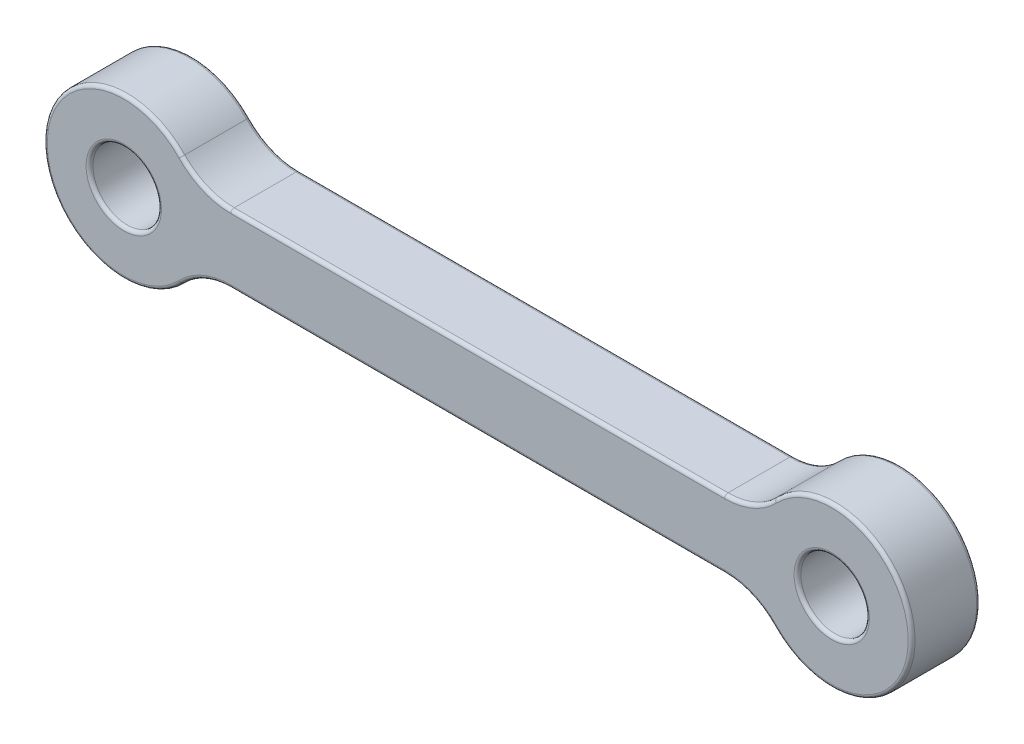
ISO-10303-21;
HEADER;
FILE_DESCRIPTION(('STEP AP214'),'2;1');
FILE_NAME('part.step','',(''),(''),'','','');
FILE_SCHEMA(('AUTOMOTIVE_DESIGN { 1 0 10303 214 1 1 1 1 }'));
ENDSEC;
DATA;
#1=APPLICATION_CONTEXT('core data for automotive mechanical design processes');
#2=APPLICATION_PROTOCOL_DEFINITION('international standard','automotive_design',2000,#1);
#3=PRODUCT_CONTEXT('',#1,'mechanical');
#4=PRODUCT('Part','Part','',(#3));
#5=PRODUCT_RELATED_PRODUCT_CATEGORY('part','',(#4));
#6=PRODUCT_DEFINITION_FORMATION('','',#4);
#7=PRODUCT_DEFINITION_CONTEXT('part definition',#1,'design');
#8=PRODUCT_DEFINITION('design','',#6,#7);
#9=PRODUCT_DEFINITION_SHAPE('','',#8);
#10=(LENGTH_UNIT() NAMED_UNIT(*) SI_UNIT(.MILLI.,.METRE.));
#11=(NAMED_UNIT(*) PLANE_ANGLE_UNIT() SI_UNIT($,.RADIAN.));
#12=(NAMED_UNIT(*) SI_UNIT($,.STERADIAN.) SOLID_ANGLE_UNIT());
#13=UNCERTAINTY_MEASURE_WITH_UNIT(LENGTH_MEASURE(1.E-05),#10,'distance_accuracy_value','');
#14=(GEOMETRIC_REPRESENTATION_CONTEXT(3) GLOBAL_UNCERTAINTY_ASSIGNED_CONTEXT((#13)) GLOBAL_UNIT_ASSIGNED_CONTEXT((#10,
#11,#12)) REPRESENTATION_CONTEXT('',''));
#15=CARTESIAN_POINT('',(0.,0.,0.));
#16=DIRECTION('',(0.,0.,1.));
#17=DIRECTION('',(1.,0.,0.));
#18=AXIS2_PLACEMENT_3D('',#15,#16,#17);
#19=CARTESIAN_POINT('',(0.,1.5,1.5));
#20=DIRECTION('',(0.,1.,0.));
#21=DIRECTION('',(0.,0.,1.));
#22=AXIS2_PLACEMENT_3D('',#19,#20,#21);
#23=PLANE('',#22);
#24=DIRECTION('',(0.,0.,1.));
#25=VECTOR('',#24,1.);
#26=CARTESIAN_POINT('',(26.3095842401766,1.5,-1.5));
#27=LINE('',#26,#25);
#28=CARTESIAN_POINT('',(26.3095842401766,1.5,1.35));
#29=VERTEX_POINT('',#28);
#30=CARTESIAN_POINT('',(26.3095842401766,1.5,-1.35));
#31=VERTEX_POINT('',#30);
#32=EDGE_CURVE('E316',#29,#31,#27,.F.);
#33=ORIENTED_EDGE('',*,*,#32,.T.);
#34=DIRECTION('',(1.,0.,0.));
#35=VECTOR('',#34,1.);
#36=CARTESIAN_POINT('',(4.69041575982343,1.5,-1.35));
#37=LINE('',#36,#35);
#38=CARTESIAN_POINT('',(4.69041575982343,1.5,-1.35));
#39=VERTEX_POINT('',#38);
#40=EDGE_CURVE('E215',#31,#39,#37,.F.);
#41=ORIENTED_EDGE('',*,*,#40,.T.);
#42=DIRECTION('',(0.,0.,-1.));
#43=VECTOR('',#42,1.);
#44=CARTESIAN_POINT('',(4.69041575982343,1.5,1.5));
#45=LINE('',#44,#43);
#46=CARTESIAN_POINT('',(4.69041575982343,1.5,1.35));
#47=VERTEX_POINT('',#46);
#48=EDGE_CURVE('E313',#39,#47,#45,.F.);
#49=ORIENTED_EDGE('',*,*,#48,.T.);
#50=DIRECTION('',(1.,0.,0.));
#51=VECTOR('',#50,1.);
#52=CARTESIAN_POINT('',(0.,1.5,1.35));
#53=LINE('',#52,#51);
#54=EDGE_CURVE('E213',#47,#29,#53,.T.);
#55=ORIENTED_EDGE('',*,*,#54,.T.);
#56=EDGE_LOOP('',(#33,#41,#49,#55));
#57=FACE_BOUND('',#56,.T.);
#58=ADVANCED_FACE('F35',(#57),#23,.T.);
#59=CARTESIAN_POINT('',(0.,0.,1.5));
#60=DIRECTION('',(0.,0.,-1.));
#61=DIRECTION('',(-1.,0.,0.));
#62=AXIS2_PLACEMENT_3D('',#59,#60,#61);
#63=CYLINDRICAL_SURFACE('',#62,3.5);
#64=DIRECTION('',(0.,0.,-1.));
#65=VECTOR('',#64,1.);
#66=CARTESIAN_POINT('',(2.52560848605877,2.42307692307692,1.5));
#67=LINE('',#66,#65);
#68=CARTESIAN_POINT('',(2.52560848605877,2.42307692307692,1.35));
#69=VERTEX_POINT('',#68);
#70=CARTESIAN_POINT('',(2.52560848605877,2.42307692307692,-1.35));
#71=VERTEX_POINT('',#70);
#72=EDGE_CURVE('E303',#69,#71,#67,.T.);
#73=ORIENTED_EDGE('',*,*,#72,.T.);
#74=CARTESIAN_POINT('',(0.,0.,-1.35));
#75=DIRECTION('',(0.,0.,1.));
#76=DIRECTION('',(1.,0.,0.));
#77=AXIS2_PLACEMENT_3D('',#74,#75,#76);
#78=CIRCLE('',#77,3.5);
#79=CARTESIAN_POINT('',(2.52560848605877,-2.42307692307692,-1.35));
#80=VERTEX_POINT('',#79);
#81=EDGE_CURVE('E223',#71,#80,#78,.T.);
#82=ORIENTED_EDGE('',*,*,#81,.T.);
#83=DIRECTION('',(0.,0.,-1.));
#84=VECTOR('',#83,1.);
#85=CARTESIAN_POINT('',(2.52560848605877,-2.42307692307692,1.5));
#86=LINE('',#85,#84);
#87=CARTESIAN_POINT('',(2.52560848605877,-2.42307692307692,1.35));
#88=VERTEX_POINT('',#87);
#89=EDGE_CURVE('E295',#80,#88,#86,.F.);
#90=ORIENTED_EDGE('',*,*,#89,.T.);
#91=CARTESIAN_POINT('',(0.,0.,1.35));
#92=DIRECTION('',(0.,0.,1.));
#93=DIRECTION('',(1.,0.,0.));
#94=AXIS2_PLACEMENT_3D('',#91,#92,#93);
#95=CIRCLE('',#94,3.5);
#96=EDGE_CURVE('E221',#88,#69,#95,.F.);
#97=ORIENTED_EDGE('',*,*,#96,.T.);
#98=EDGE_LOOP('',(#73,#82,#90,#97));
#99=FACE_BOUND('',#98,.T.);
#100=ADVANCED_FACE('F300',(#99),#63,.T.);
#101=CARTESIAN_POINT('',(0.,-1.5,1.5));
#102=DIRECTION('',(0.,1.,0.));
#103=DIRECTION('',(0.,0.,1.));
#104=AXIS2_PLACEMENT_3D('',#101,#102,#103);
#105=PLANE('',#104);
#106=DIRECTION('',(0.,0.,1.));
#107=VECTOR('',#106,1.);
#108=CARTESIAN_POINT('',(4.69041575982343,-1.5,-1.5));
#109=LINE('',#108,#107);
#110=CARTESIAN_POINT('',(4.69041575982343,-1.5,1.35));
#111=VERTEX_POINT('',#110);
#112=CARTESIAN_POINT('',(4.69041575982343,-1.5,-1.35));
#113=VERTEX_POINT('',#112);
#114=EDGE_CURVE('E297',#111,#113,#109,.F.);
#115=ORIENTED_EDGE('',*,*,#114,.T.);
#116=DIRECTION('',(1.,0.,0.));
#117=VECTOR('',#116,1.);
#118=CARTESIAN_POINT('',(0.,-1.5,-1.35));
#119=LINE('',#118,#117);
#120=CARTESIAN_POINT('',(26.3095842401766,-1.5,-1.35));
#121=VERTEX_POINT('',#120);
#122=EDGE_CURVE('E198',#113,#121,#119,.T.);
#123=ORIENTED_EDGE('',*,*,#122,.T.);
#124=DIRECTION('',(0.,0.,-1.));
#125=VECTOR('',#124,1.);
#126=CARTESIAN_POINT('',(26.3095842401766,-1.5,1.5));
#127=LINE('',#126,#125);
#128=CARTESIAN_POINT('',(26.3095842401766,-1.5,1.35));
#129=VERTEX_POINT('',#128);
#130=EDGE_CURVE('E258',#121,#129,#127,.F.);
#131=ORIENTED_EDGE('',*,*,#130,.T.);
#132=DIRECTION('',(1.,0.,0.));
#133=VECTOR('',#132,1.);
#134=CARTESIAN_POINT('',(4.69041575982343,-1.5,1.35));
#135=LINE('',#134,#133);
#136=EDGE_CURVE('E196',#129,#111,#135,.F.);
#137=ORIENTED_EDGE('',*,*,#136,.T.);
#138=EDGE_LOOP('',(#115,#123,#131,#137));
#139=FACE_BOUND('',#138,.T.);
#140=ADVANCED_FACE('F343',(#139),#105,.F.);
#141=CARTESIAN_POINT('',(0.,0.,1.5));
#142=DIRECTION('',(0.,0.,-1.));
#143=DIRECTION('',(-1.,0.,0.));
#144=AXIS2_PLACEMENT_3D('',#141,#142,#143);
#145=CYLINDRICAL_SURFACE('',#144,1.5);
#146=CARTESIAN_POINT('',(0.,0.,-1.35));
#147=DIRECTION('',(0.,0.,1.));
#148=DIRECTION('',(1.,0.,0.));
#149=AXIS2_PLACEMENT_3D('',#146,#147,#148);
#150=CIRCLE('',#149,1.5);
#151=CARTESIAN_POINT('',(1.5,0.,-1.35));
#152=VERTEX_POINT('',#151);
#153=EDGE_CURVE('E190',#152,#152,#150,.F.);
#154=ORIENTED_EDGE('',*,*,#153,.T.);
#155=EDGE_LOOP('',(#154));
#156=FACE_BOUND('',#155,.T.);
#157=CARTESIAN_POINT('',(0.,0.,1.35));
#158=DIRECTION('',(0.,0.,1.));
#159=DIRECTION('',(1.,0.,0.));
#160=AXIS2_PLACEMENT_3D('',#157,#158,#159);
#161=CIRCLE('',#160,1.5);
#162=CARTESIAN_POINT('',(1.5,0.,1.35));
#163=VERTEX_POINT('',#162);
#164=EDGE_CURVE('E187',#163,#163,#161,.T.);
#165=ORIENTED_EDGE('',*,*,#164,.T.);
#166=EDGE_LOOP('',(#165));
#167=FACE_BOUND('',#166,.T.);
#168=ADVANCED_FACE('F390',(#156,#167),#145,.F.);
#169=CARTESIAN_POINT('',(31.,0.,1.5));
#170=DIRECTION('',(0.,0.,-1.));
#171=DIRECTION('',(-1.,0.,0.));
#172=AXIS2_PLACEMENT_3D('',#169,#170,#171);
#173=CYLINDRICAL_SURFACE('',#172,3.5);
#174=DIRECTION('',(0.,0.,-1.));
#175=VECTOR('',#174,1.);
#176=CARTESIAN_POINT('',(28.4743915139412,-2.42307692307692,1.5));
#177=LINE('',#176,#175);
#178=CARTESIAN_POINT('',(28.4743915139412,-2.42307692307692,1.35));
#179=VERTEX_POINT('',#178);
#180=CARTESIAN_POINT('',(28.4743915139412,-2.42307692307692,-1.35));
#181=VERTEX_POINT('',#180);
#182=EDGE_CURVE('E306',#179,#181,#177,.T.);
#183=ORIENTED_EDGE('',*,*,#182,.T.);
#184=CARTESIAN_POINT('',(31.,0.,-1.35));
#185=DIRECTION('',(0.,0.,1.));
#186=DIRECTION('',(1.,0.,0.));
#187=AXIS2_PLACEMENT_3D('',#184,#185,#186);
#188=CIRCLE('',#187,3.5);
#189=CARTESIAN_POINT('',(28.4743915139412,2.42307692307692,-1.35));
#190=VERTEX_POINT('',#189);
#191=EDGE_CURVE('E206',#181,#190,#188,.T.);
#192=ORIENTED_EDGE('',*,*,#191,.T.);
#193=DIRECTION('',(0.,0.,-1.));
#194=VECTOR('',#193,1.);
#195=CARTESIAN_POINT('',(28.4743915139412,2.42307692307692,1.5));
#196=LINE('',#195,#194);
#197=CARTESIAN_POINT('',(28.4743915139412,2.42307692307692,1.35));
#198=VERTEX_POINT('',#197);
#199=EDGE_CURVE('E302',#190,#198,#196,.F.);
#200=ORIENTED_EDGE('',*,*,#199,.T.);
#201=CARTESIAN_POINT('',(31.,0.,1.35));
#202=DIRECTION('',(0.,0.,1.));
#203=DIRECTION('',(1.,0.,0.));
#204=AXIS2_PLACEMENT_3D('',#201,#202,#203);
#205=CIRCLE('',#204,3.5);
#206=EDGE_CURVE('E204',#198,#179,#205,.F.);
#207=ORIENTED_EDGE('',*,*,#206,.T.);
#208=EDGE_LOOP('',(#183,#192,#200,#207));
#209=FACE_BOUND('',#208,.T.);
#210=ADVANCED_FACE('F387',(#209),#173,.T.);
#211=CARTESIAN_POINT('',(31.,0.,1.5));
#212=DIRECTION('',(0.,0.,-1.));
#213=DIRECTION('',(-1.,0.,0.));
#214=AXIS2_PLACEMENT_3D('',#211,#212,#213);
#215=CYLINDRICAL_SURFACE('',#214,1.5);
#216=CARTESIAN_POINT('',(31.,0.,-1.35));
#217=DIRECTION('',(0.,0.,1.));
#218=DIRECTION('',(1.,0.,0.));
#219=AXIS2_PLACEMENT_3D('',#216,#217,#218);
#220=CIRCLE('',#219,1.5);
#221=CARTESIAN_POINT('',(32.5,0.,-1.35));
#222=VERTEX_POINT('',#221);
#223=EDGE_CURVE('E170',#222,#222,#220,.F.);
#224=ORIENTED_EDGE('',*,*,#223,.T.);
#225=EDGE_LOOP('',(#224));
#226=FACE_BOUND('',#225,.T.);
#227=CARTESIAN_POINT('',(31.,0.,1.35));
#228=DIRECTION('',(0.,0.,1.));
#229=DIRECTION('',(1.,0.,0.));
#230=AXIS2_PLACEMENT_3D('',#227,#228,#229);
#231=CIRCLE('',#230,1.5);
#232=CARTESIAN_POINT('',(32.5,0.,1.35));
#233=VERTEX_POINT('',#232);
#234=EDGE_CURVE('E319',#233,#233,#231,.T.);
#235=ORIENTED_EDGE('',*,*,#234,.T.);
#236=EDGE_LOOP('',(#235));
#237=FACE_BOUND('',#236,.T.);
#238=ADVANCED_FACE('F389',(#226,#237),#215,.F.);
#239=CARTESIAN_POINT('',(0.,0.,1.5));
#240=DIRECTION('',(0.,0.,1.));
#241=DIRECTION('',(1.,0.,0.));
#242=AXIS2_PLACEMENT_3D('',#239,#240,#241);
#243=PLANE('',#242);
#244=CARTESIAN_POINT('',(31.,0.,1.5));
#245=DIRECTION('',(0.,0.,1.));
#246=DIRECTION('',(1.,0.,0.));
#247=AXIS2_PLACEMENT_3D('',#244,#245,#246);
#248=CIRCLE('',#247,1.65);
#249=CARTESIAN_POINT('',(32.65,0.,1.5));
#250=VERTEX_POINT('',#249);
#251=EDGE_CURVE('E11',#250,#250,#248,.F.);
#252=ORIENTED_EDGE('',*,*,#251,.T.);
#253=EDGE_LOOP('',(#252));
#254=FACE_BOUND('',#253,.T.);
#255=CARTESIAN_POINT('',(0.,0.,1.5));
#256=DIRECTION('',(0.,0.,1.));
#257=DIRECTION('',(1.,0.,0.));
#258=AXIS2_PLACEMENT_3D('',#255,#256,#257);
#259=CIRCLE('',#258,1.65);
#260=CARTESIAN_POINT('',(1.65,0.,1.5));
#261=VERTEX_POINT('',#260);
#262=EDGE_CURVE('E44',#261,#261,#259,.F.);
#263=ORIENTED_EDGE('',*,*,#262,.T.);
#264=EDGE_LOOP('',(#263));
#265=FACE_BOUND('',#264,.T.);
#266=CARTESIAN_POINT('',(31.,0.,1.5));
#267=DIRECTION('',(0.,0.,1.));
#268=DIRECTION('',(1.,0.,0.));
#269=AXIS2_PLACEMENT_3D('',#266,#267,#268);
#270=CIRCLE('',#269,3.35);
#271=CARTESIAN_POINT('',(28.5826318776295,-2.31923076923077,1.5));
#272=VERTEX_POINT('',#271);
#273=CARTESIAN_POINT('',(28.5826318776295,2.31923076923077,1.5));
#274=VERTEX_POINT('',#273);
#275=EDGE_CURVE('E52',#272,#274,#270,.T.);
#276=ORIENTED_EDGE('',*,*,#275,.T.);
#277=CARTESIAN_POINT('',(26.3095842401766,4.5,1.5));
#278=DIRECTION('',(0.,0.,1.));
#279=DIRECTION('',(1.,0.,0.));
#280=AXIS2_PLACEMENT_3D('',#277,#278,#279);
#281=CIRCLE('',#280,3.15);
#282=CARTESIAN_POINT('',(26.3095842401766,1.35,1.5));
#283=VERTEX_POINT('',#282);
#284=EDGE_CURVE('E237',#274,#283,#281,.F.);
#285=ORIENTED_EDGE('',*,*,#284,.T.);
#286=DIRECTION('',(1.,0.,0.));
#287=VECTOR('',#286,1.);
#288=CARTESIAN_POINT('',(0.,1.35,1.5));
#289=LINE('',#288,#287);
#290=CARTESIAN_POINT('',(4.69041575982343,1.35,1.5));
#291=VERTEX_POINT('',#290);
#292=EDGE_CURVE('E225',#283,#291,#289,.F.);
#293=ORIENTED_EDGE('',*,*,#292,.T.);
#294=CARTESIAN_POINT('',(4.69041575982343,4.5,1.5));
#295=DIRECTION('',(0.,0.,1.));
#296=DIRECTION('',(1.,0.,0.));
#297=AXIS2_PLACEMENT_3D('',#294,#295,#296);
#298=CIRCLE('',#297,3.15);
#299=CARTESIAN_POINT('',(2.41736812237054,2.31923076923077,1.5));
#300=VERTEX_POINT('',#299);
#301=EDGE_CURVE('E227',#291,#300,#298,.F.);
#302=ORIENTED_EDGE('',*,*,#301,.T.);
#303=CARTESIAN_POINT('',(0.,0.,1.5));
#304=DIRECTION('',(0.,0.,1.));
#305=DIRECTION('',(1.,0.,0.));
#306=AXIS2_PLACEMENT_3D('',#303,#304,#305);
#307=CIRCLE('',#306,3.35);
#308=CARTESIAN_POINT('',(2.41736812237054,-2.31923076923077,1.5));
#309=VERTEX_POINT('',#308);
#310=EDGE_CURVE('E229',#300,#309,#307,.T.);
#311=ORIENTED_EDGE('',*,*,#310,.T.);
#312=CARTESIAN_POINT('',(4.69041575982343,-4.5,1.5));
#313=DIRECTION('',(0.,0.,1.));
#314=DIRECTION('',(1.,0.,0.));
#315=AXIS2_PLACEMENT_3D('',#312,#313,#314);
#316=CIRCLE('',#315,3.15);
#317=CARTESIAN_POINT('',(4.69041575982343,-1.35,1.5));
#318=VERTEX_POINT('',#317);
#319=EDGE_CURVE('E231',#309,#318,#316,.F.);
#320=ORIENTED_EDGE('',*,*,#319,.T.);
#321=DIRECTION('',(1.,0.,0.));
#322=VECTOR('',#321,1.);
#323=CARTESIAN_POINT('',(26.3095842401766,-1.35,1.5));
#324=LINE('',#323,#322);
#325=CARTESIAN_POINT('',(26.3095842401766,-1.35,1.5));
#326=VERTEX_POINT('',#325);
#327=EDGE_CURVE('E233',#318,#326,#324,.T.);
#328=ORIENTED_EDGE('',*,*,#327,.T.);
#329=CARTESIAN_POINT('',(26.3095842401766,-4.5,1.5));
#330=DIRECTION('',(0.,0.,1.));
#331=DIRECTION('',(1.,0.,0.));
#332=AXIS2_PLACEMENT_3D('',#329,#330,#331);
#333=CIRCLE('',#332,3.15);
#334=EDGE_CURVE('E57',#326,#272,#333,.F.);
#335=ORIENTED_EDGE('',*,*,#334,.T.);
#336=EDGE_LOOP('',(#276,#285,#293,#302,#311,#320,#328,#335));
#337=FACE_BOUND('',#336,.T.);
#338=ADVANCED_FACE('F360',(#254,#265,#337),#243,.T.);
#339=CARTESIAN_POINT('',(0.,0.,-1.5));
#340=DIRECTION('',(0.,0.,1.));
#341=DIRECTION('',(1.,0.,0.));
#342=AXIS2_PLACEMENT_3D('',#339,#340,#341);
#343=PLANE('',#342);
#344=CARTESIAN_POINT('',(31.,0.,-1.5));
#345=DIRECTION('',(0.,0.,1.));
#346=DIRECTION('',(1.,0.,0.));
#347=AXIS2_PLACEMENT_3D('',#344,#345,#346);
#348=CIRCLE('',#347,1.65);
#349=CARTESIAN_POINT('',(32.65,0.,-1.5));
#350=VERTEX_POINT('',#349);
#351=EDGE_CURVE('E179',#350,#350,#348,.T.);
#352=ORIENTED_EDGE('',*,*,#351,.T.);
#353=EDGE_LOOP('',(#352));
#354=FACE_BOUND('',#353,.T.);
#355=CARTESIAN_POINT('',(0.,0.,-1.5));
#356=DIRECTION('',(0.,0.,1.));
#357=DIRECTION('',(1.,0.,0.));
#358=AXIS2_PLACEMENT_3D('',#355,#356,#357);
#359=CIRCLE('',#358,1.65);
#360=CARTESIAN_POINT('',(1.65,0.,-1.5));
#361=VERTEX_POINT('',#360);
#362=EDGE_CURVE('E176',#361,#361,#359,.T.);
#363=ORIENTED_EDGE('',*,*,#362,.T.);
#364=EDGE_LOOP('',(#363));
#365=FACE_BOUND('',#364,.T.);
#366=DIRECTION('',(1.,0.,0.));
#367=VECTOR('',#366,1.);
#368=CARTESIAN_POINT('',(0.,-1.35,-1.5));
#369=LINE('',#368,#367);
#370=CARTESIAN_POINT('',(26.3095842401766,-1.35,-1.5));
#371=VERTEX_POINT('',#370);
#372=CARTESIAN_POINT('',(4.69041575982343,-1.35,-1.5));
#373=VERTEX_POINT('',#372);
#374=EDGE_CURVE('E174',#371,#373,#369,.F.);
#375=ORIENTED_EDGE('',*,*,#374,.T.);
#376=CARTESIAN_POINT('',(4.69041575982343,-4.5,-1.5));
#377=DIRECTION('',(0.,0.,1.));
#378=DIRECTION('',(1.,0.,0.));
#379=AXIS2_PLACEMENT_3D('',#376,#377,#378);
#380=CIRCLE('',#379,3.15);
#381=CARTESIAN_POINT('',(2.41736812237054,-2.31923076923077,-1.5));
#382=VERTEX_POINT('',#381);
#383=EDGE_CURVE('E155',#373,#382,#380,.T.);
#384=ORIENTED_EDGE('',*,*,#383,.T.);
#385=CARTESIAN_POINT('',(0.,0.,-1.5));
#386=DIRECTION('',(0.,0.,1.));
#387=DIRECTION('',(1.,0.,0.));
#388=AXIS2_PLACEMENT_3D('',#385,#386,#387);
#389=CIRCLE('',#388,3.35);
#390=CARTESIAN_POINT('',(2.41736812237054,2.31923076923077,-1.5));
#391=VERTEX_POINT('',#390);
#392=EDGE_CURVE('E163',#382,#391,#389,.F.);
#393=ORIENTED_EDGE('',*,*,#392,.T.);
#394=CARTESIAN_POINT('',(4.69041575982343,4.5,-1.5));
#395=DIRECTION('',(0.,0.,1.));
#396=DIRECTION('',(1.,0.,0.));
#397=AXIS2_PLACEMENT_3D('',#394,#395,#396);
#398=CIRCLE('',#397,3.15);
#399=CARTESIAN_POINT('',(4.69041575982343,1.35,-1.5));
#400=VERTEX_POINT('',#399);
#401=EDGE_CURVE('E169',#391,#400,#398,.T.);
#402=ORIENTED_EDGE('',*,*,#401,.T.);
#403=DIRECTION('',(1.,0.,0.));
#404=VECTOR('',#403,1.);
#405=CARTESIAN_POINT('',(26.3095842401766,1.35,-1.5));
#406=LINE('',#405,#404);
#407=CARTESIAN_POINT('',(26.3095842401766,1.35,-1.5));
#408=VERTEX_POINT('',#407);
#409=EDGE_CURVE('E325',#400,#408,#406,.T.);
#410=ORIENTED_EDGE('',*,*,#409,.T.);
#411=CARTESIAN_POINT('',(26.3095842401766,4.5,-1.5));
#412=DIRECTION('',(0.,0.,1.));
#413=DIRECTION('',(1.,0.,0.));
#414=AXIS2_PLACEMENT_3D('',#411,#412,#413);
#415=CIRCLE('',#414,3.15);
#416=CARTESIAN_POINT('',(28.5826318776295,2.31923076923077,-1.5));
#417=VERTEX_POINT('',#416);
#418=EDGE_CURVE('E327',#408,#417,#415,.T.);
#419=ORIENTED_EDGE('',*,*,#418,.T.);
#420=CARTESIAN_POINT('',(31.,0.,-1.5));
#421=DIRECTION('',(0.,0.,1.));
#422=DIRECTION('',(1.,0.,0.));
#423=AXIS2_PLACEMENT_3D('',#420,#421,#422);
#424=CIRCLE('',#423,3.35);
#425=CARTESIAN_POINT('',(28.5826318776295,-2.31923076923077,-1.5));
#426=VERTEX_POINT('',#425);
#427=EDGE_CURVE('E329',#417,#426,#424,.F.);
#428=ORIENTED_EDGE('',*,*,#427,.T.);
#429=CARTESIAN_POINT('',(26.3095842401766,-4.5,-1.5));
#430=DIRECTION('',(0.,0.,1.));
#431=DIRECTION('',(1.,0.,0.));
#432=AXIS2_PLACEMENT_3D('',#429,#430,#431);
#433=CIRCLE('',#432,3.15);
#434=EDGE_CURVE('E181',#426,#371,#433,.T.);
#435=ORIENTED_EDGE('',*,*,#434,.T.);
#436=EDGE_LOOP('',(#375,#384,#393,#402,#410,#419,#428,#435));
#437=FACE_BOUND('',#436,.T.);
#438=ADVANCED_FACE('F172',(#354,#365,#437),#343,.F.);
#439=CARTESIAN_POINT('',(4.69041575982343,-4.5,1.5));
#440=DIRECTION('',(0.,0.,-1.));
#441=DIRECTION('',(-1.,0.,0.));
#442=AXIS2_PLACEMENT_3D('',#439,#440,#441);
#443=CYLINDRICAL_SURFACE('',#442,3.);
#444=ORIENTED_EDGE('',*,*,#89,.F.);
#445=CARTESIAN_POINT('',(4.69041575982343,-4.5,-1.35));
#446=DIRECTION('',(0.,0.,1.));
#447=DIRECTION('',(1.,0.,0.));
#448=AXIS2_PLACEMENT_3D('',#445,#446,#447);
#449=CIRCLE('',#448,3.);
#450=EDGE_CURVE('E157',#80,#113,#449,.F.);
#451=ORIENTED_EDGE('',*,*,#450,.T.);
#452=ORIENTED_EDGE('',*,*,#114,.F.);
#453=CARTESIAN_POINT('',(4.69041575982343,-4.5,1.35));
#454=DIRECTION('',(0.,0.,1.));
#455=DIRECTION('',(1.,0.,0.));
#456=AXIS2_PLACEMENT_3D('',#453,#454,#455);
#457=CIRCLE('',#456,3.);
#458=EDGE_CURVE('E193',#111,#88,#457,.T.);
#459=ORIENTED_EDGE('',*,*,#458,.T.);
#460=EDGE_LOOP('',(#444,#451,#452,#459));
#461=FACE_BOUND('',#460,.T.);
#462=ADVANCED_FACE('F294',(#461),#443,.F.);
#463=CARTESIAN_POINT('',(26.3095842401766,-4.5,1.5));
#464=DIRECTION('',(0.,0.,-1.));
#465=DIRECTION('',(-1.,0.,0.));
#466=AXIS2_PLACEMENT_3D('',#463,#464,#465);
#467=CYLINDRICAL_SURFACE('',#466,3.);
#468=ORIENTED_EDGE('',*,*,#130,.F.);
#469=CARTESIAN_POINT('',(26.3095842401766,-4.5,-1.35));
#470=DIRECTION('',(0.,0.,1.));
#471=DIRECTION('',(1.,0.,0.));
#472=AXIS2_PLACEMENT_3D('',#469,#470,#471);
#473=CIRCLE('',#472,3.);
#474=EDGE_CURVE('E202',#121,#181,#473,.F.);
#475=ORIENTED_EDGE('',*,*,#474,.T.);
#476=ORIENTED_EDGE('',*,*,#182,.F.);
#477=CARTESIAN_POINT('',(26.3095842401766,-4.5,1.35));
#478=DIRECTION('',(0.,0.,1.));
#479=DIRECTION('',(1.,0.,0.));
#480=AXIS2_PLACEMENT_3D('',#477,#478,#479);
#481=CIRCLE('',#480,3.);
#482=EDGE_CURVE('E200',#179,#129,#481,.T.);
#483=ORIENTED_EDGE('',*,*,#482,.T.);
#484=EDGE_LOOP('',(#468,#475,#476,#483));
#485=FACE_BOUND('',#484,.T.);
#486=ADVANCED_FACE('F346',(#485),#467,.F.);
#487=CARTESIAN_POINT('',(26.3095842401766,4.5,1.5));
#488=DIRECTION('',(0.,0.,-1.));
#489=DIRECTION('',(-1.,0.,0.));
#490=AXIS2_PLACEMENT_3D('',#487,#488,#489);
#491=CYLINDRICAL_SURFACE('',#490,3.);
#492=ORIENTED_EDGE('',*,*,#199,.F.);
#493=CARTESIAN_POINT('',(26.3095842401766,4.5,-1.35));
#494=DIRECTION('',(0.,0.,1.));
#495=DIRECTION('',(1.,0.,0.));
#496=AXIS2_PLACEMENT_3D('',#493,#494,#495);
#497=CIRCLE('',#496,3.);
#498=EDGE_CURVE('E211',#190,#31,#497,.F.);
#499=ORIENTED_EDGE('',*,*,#498,.T.);
#500=ORIENTED_EDGE('',*,*,#32,.F.);
#501=CARTESIAN_POINT('',(26.3095842401766,4.5,1.35));
#502=DIRECTION('',(0.,0.,1.));
#503=DIRECTION('',(1.,0.,0.));
#504=AXIS2_PLACEMENT_3D('',#501,#502,#503);
#505=CIRCLE('',#504,3.);
#506=EDGE_CURVE('E208',#29,#198,#505,.T.);
#507=ORIENTED_EDGE('',*,*,#506,.T.);
#508=EDGE_LOOP('',(#492,#499,#500,#507));
#509=FACE_BOUND('',#508,.T.);
#510=ADVANCED_FACE('F376',(#509),#491,.F.);
#511=CARTESIAN_POINT('',(4.69041575982343,4.5,1.5));
#512=DIRECTION('',(0.,0.,-1.));
#513=DIRECTION('',(-1.,0.,0.));
#514=AXIS2_PLACEMENT_3D('',#511,#512,#513);
#515=CYLINDRICAL_SURFACE('',#514,3.);
#516=ORIENTED_EDGE('',*,*,#48,.F.);
#517=CARTESIAN_POINT('',(4.69041575982343,4.5,-1.35));
#518=DIRECTION('',(0.,0.,1.));
#519=DIRECTION('',(1.,0.,0.));
#520=AXIS2_PLACEMENT_3D('',#517,#518,#519);
#521=CIRCLE('',#520,3.);
#522=EDGE_CURVE('E219',#39,#71,#521,.F.);
#523=ORIENTED_EDGE('',*,*,#522,.T.);
#524=ORIENTED_EDGE('',*,*,#72,.F.);
#525=CARTESIAN_POINT('',(4.69041575982343,4.5,1.35));
#526=DIRECTION('',(0.,0.,1.));
#527=DIRECTION('',(1.,0.,0.));
#528=AXIS2_PLACEMENT_3D('',#525,#526,#527);
#529=CIRCLE('',#528,3.);
#530=EDGE_CURVE('E217',#69,#47,#529,.T.);
#531=ORIENTED_EDGE('',*,*,#530,.T.);
#532=EDGE_LOOP('',(#516,#523,#524,#531));
#533=FACE_BOUND('',#532,.T.);
#534=ADVANCED_FACE('F414',(#533),#515,.F.);
#535=CARTESIAN_POINT('',(31.,0.,-1.35));
#536=DIRECTION('',(0.,0.,1.));
#537=DIRECTION('',(1.,0.,0.));
#538=AXIS2_PLACEMENT_3D('',#535,#536,#537);
#539=TOROIDAL_SURFACE('',#538,1.65,0.15);
#540=ORIENTED_EDGE('',*,*,#351,.F.);
#541=EDGE_LOOP('',(#540));
#542=FACE_BOUND('',#541,.T.);
#543=ORIENTED_EDGE('',*,*,#223,.F.);
#544=EDGE_LOOP('',(#543));
#545=FACE_BOUND('',#544,.T.);
#546=ADVANCED_FACE('F417',(#542,#545),#539,.T.);
#547=CARTESIAN_POINT('',(0.,0.,-1.35));
#548=DIRECTION('',(0.,0.,1.));
#549=DIRECTION('',(1.,0.,0.));
#550=AXIS2_PLACEMENT_3D('',#547,#548,#549);
#551=TOROIDAL_SURFACE('',#550,1.65,0.15);
#552=ORIENTED_EDGE('',*,*,#153,.F.);
#553=EDGE_LOOP('',(#552));
#554=FACE_BOUND('',#553,.T.);
#555=ORIENTED_EDGE('',*,*,#362,.F.);
#556=EDGE_LOOP('',(#555));
#557=FACE_BOUND('',#556,.T.);
#558=ADVANCED_FACE('F421',(#554,#557),#551,.T.);
#559=CARTESIAN_POINT('',(26.3095842401766,4.5,-1.35));
#560=DIRECTION('',(0.,0.,1.));
#561=DIRECTION('',(1.,0.,0.));
#562=AXIS2_PLACEMENT_3D('',#559,#560,#561);
#563=TOROIDAL_SURFACE('',#562,3.15,0.15);
#564=CARTESIAN_POINT('',(26.3095842401766,1.35,-1.35));
#565=DIRECTION('',(-1.,0.,0.));
#566=DIRECTION('',(0.,0.,1.));
#567=AXIS2_PLACEMENT_3D('',#564,#565,#566);
#568=CIRCLE('',#567,0.15);
#569=EDGE_CURVE('E252',#31,#408,#568,.T.);
#570=ORIENTED_EDGE('',*,*,#569,.F.);
#571=ORIENTED_EDGE('',*,*,#498,.F.);
#572=CARTESIAN_POINT('',(28.5826318776295,2.31923076923077,-1.35));
#573=DIRECTION('',(0.692307692307703,0.72160242458821,0.));
#574=DIRECTION('',(-0.72160242458821,0.692307692307703,0.));
#575=AXIS2_PLACEMENT_3D('',#572,#573,#574);
#576=CIRCLE('',#575,0.15);
#577=EDGE_CURVE('E255',#417,#190,#576,.T.);
#578=ORIENTED_EDGE('',*,*,#577,.F.);
#579=ORIENTED_EDGE('',*,*,#418,.F.);
#580=EDGE_LOOP('',(#570,#571,#578,#579));
#581=FACE_BOUND('',#580,.T.);
#582=ADVANCED_FACE('F380',(#581),#563,.T.);
#583=CARTESIAN_POINT('',(31.,0.,-1.35));
#584=DIRECTION('',(0.,0.,1.));
#585=DIRECTION('',(1.,0.,0.));
#586=AXIS2_PLACEMENT_3D('',#583,#584,#585);
#587=TOROIDAL_SURFACE('',#586,3.35,0.15);
#588=ORIENTED_EDGE('',*,*,#577,.T.);
#589=ORIENTED_EDGE('',*,*,#191,.F.);
#590=CARTESIAN_POINT('',(28.5826318776295,-2.31923076923077,-1.35));
#591=DIRECTION('',(-0.692307692307698,0.721602424588214,0.));
#592=DIRECTION('',(-0.721602424588214,-0.692307692307698,0.));
#593=AXIS2_PLACEMENT_3D('',#590,#591,#592);
#594=CIRCLE('',#593,0.15);
#595=EDGE_CURVE('E249',#426,#181,#594,.T.);
#596=ORIENTED_EDGE('',*,*,#595,.F.);
#597=ORIENTED_EDGE('',*,*,#427,.F.);
#598=EDGE_LOOP('',(#588,#589,#596,#597));
#599=FACE_BOUND('',#598,.T.);
#600=ADVANCED_FACE('F385',(#599),#587,.T.);
#601=CARTESIAN_POINT('',(0.,1.35,-1.35));
#602=DIRECTION('',(-1.,0.,0.));
#603=DIRECTION('',(0.,0.,1.));
#604=AXIS2_PLACEMENT_3D('',#601,#602,#603);
#605=CYLINDRICAL_SURFACE('',#604,0.15);
#606=ORIENTED_EDGE('',*,*,#569,.T.);
#607=ORIENTED_EDGE('',*,*,#409,.F.);
#608=CARTESIAN_POINT('',(4.69041575982343,1.35,-1.35));
#609=DIRECTION('',(-1.,0.,0.));
#610=DIRECTION('',(0.,0.,1.));
#611=AXIS2_PLACEMENT_3D('',#608,#609,#610);
#612=CIRCLE('',#611,0.15);
#613=EDGE_CURVE('E246',#39,#400,#612,.T.);
#614=ORIENTED_EDGE('',*,*,#613,.F.);
#615=ORIENTED_EDGE('',*,*,#40,.F.);
#616=EDGE_LOOP('',(#606,#607,#614,#615));
#617=FACE_BOUND('',#616,.T.);
#618=ADVANCED_FACE('F439',(#617),#605,.T.);
#619=CARTESIAN_POINT('',(26.3095842401766,-4.5,-1.35));
#620=DIRECTION('',(0.,0.,1.));
#621=DIRECTION('',(1.,0.,0.));
#622=AXIS2_PLACEMENT_3D('',#619,#620,#621);
#623=TOROIDAL_SURFACE('',#622,3.15,0.15);
#624=ORIENTED_EDGE('',*,*,#595,.T.);
#625=ORIENTED_EDGE('',*,*,#474,.F.);
#626=CARTESIAN_POINT('',(26.3095842401766,-1.35,-1.35));
#627=DIRECTION('',(-1.,0.,0.));
#628=DIRECTION('',(0.,0.,1.));
#629=AXIS2_PLACEMENT_3D('',#626,#627,#628);
#630=CIRCLE('',#629,0.15);
#631=EDGE_CURVE('E243',#371,#121,#630,.T.);
#632=ORIENTED_EDGE('',*,*,#631,.F.);
#633=ORIENTED_EDGE('',*,*,#434,.F.);
#634=EDGE_LOOP('',(#624,#625,#632,#633));
#635=FACE_BOUND('',#634,.T.);
#636=ADVANCED_FACE('F336',(#635),#623,.T.);
#637=CARTESIAN_POINT('',(4.69041575982343,4.5,-1.35));
#638=DIRECTION('',(0.,0.,1.));
#639=DIRECTION('',(1.,0.,0.));
#640=AXIS2_PLACEMENT_3D('',#637,#638,#639);
#641=TOROIDAL_SURFACE('',#640,3.15,0.15);
#642=ORIENTED_EDGE('',*,*,#613,.T.);
#643=ORIENTED_EDGE('',*,*,#401,.F.);
#644=CARTESIAN_POINT('',(2.41736812237054,2.31923076923077,-1.35));
#645=DIRECTION('',(-0.692307692307693,0.72160242458822,0.));
#646=DIRECTION('',(-0.72160242458822,-0.692307692307693,0.));
#647=AXIS2_PLACEMENT_3D('',#644,#645,#646);
#648=CIRCLE('',#647,0.15);
#649=EDGE_CURVE('E166',#71,#391,#648,.T.);
#650=ORIENTED_EDGE('',*,*,#649,.F.);
#651=ORIENTED_EDGE('',*,*,#522,.F.);
#652=EDGE_LOOP('',(#642,#643,#650,#651));
#653=FACE_BOUND('',#652,.T.);
#654=ADVANCED_FACE('F433',(#653),#641,.T.);
#655=CARTESIAN_POINT('',(0.,-1.35,-1.35));
#656=DIRECTION('',(1.,0.,0.));
#657=DIRECTION('',(0.,0.,-1.));
#658=AXIS2_PLACEMENT_3D('',#655,#656,#657);
#659=CYLINDRICAL_SURFACE('',#658,0.15);
#660=ORIENTED_EDGE('',*,*,#631,.T.);
#661=ORIENTED_EDGE('',*,*,#122,.F.);
#662=CARTESIAN_POINT('',(4.69041575982343,-1.35,-1.35));
#663=DIRECTION('',(-1.,0.,0.));
#664=DIRECTION('',(0.,0.,1.));
#665=AXIS2_PLACEMENT_3D('',#662,#663,#664);
#666=CIRCLE('',#665,0.15);
#667=EDGE_CURVE('E160',#373,#113,#666,.T.);
#668=ORIENTED_EDGE('',*,*,#667,.F.);
#669=ORIENTED_EDGE('',*,*,#374,.F.);
#670=EDGE_LOOP('',(#660,#661,#668,#669));
#671=FACE_BOUND('',#670,.T.);
#672=ADVANCED_FACE('F339',(#671),#659,.T.);
#673=CARTESIAN_POINT('',(0.,0.,-1.35));
#674=DIRECTION('',(0.,0.,1.));
#675=DIRECTION('',(1.,0.,0.));
#676=AXIS2_PLACEMENT_3D('',#673,#674,#675);
#677=TOROIDAL_SURFACE('',#676,3.35,0.15);
#678=ORIENTED_EDGE('',*,*,#649,.T.);
#679=ORIENTED_EDGE('',*,*,#392,.F.);
#680=CARTESIAN_POINT('',(2.41736812237054,-2.31923076923077,-1.35));
#681=DIRECTION('',(0.692307692307693,0.72160242458822,0.));
#682=DIRECTION('',(-0.72160242458822,0.692307692307693,0.));
#683=AXIS2_PLACEMENT_3D('',#680,#681,#682);
#684=CIRCLE('',#683,0.15);
#685=EDGE_CURVE('E151',#80,#382,#684,.T.);
#686=ORIENTED_EDGE('',*,*,#685,.F.);
#687=ORIENTED_EDGE('',*,*,#81,.F.);
#688=EDGE_LOOP('',(#678,#679,#686,#687));
#689=FACE_BOUND('',#688,.T.);
#690=ADVANCED_FACE('F164',(#689),#677,.T.);
#691=CARTESIAN_POINT('',(4.69041575982343,-4.5,-1.35));
#692=DIRECTION('',(0.,0.,1.));
#693=DIRECTION('',(1.,0.,0.));
#694=AXIS2_PLACEMENT_3D('',#691,#692,#693);
#695=TOROIDAL_SURFACE('',#694,3.15,0.15);
#696=ORIENTED_EDGE('',*,*,#667,.T.);
#697=ORIENTED_EDGE('',*,*,#450,.F.);
#698=ORIENTED_EDGE('',*,*,#685,.T.);
#699=ORIENTED_EDGE('',*,*,#383,.F.);
#700=EDGE_LOOP('',(#696,#697,#698,#699));
#701=FACE_BOUND('',#700,.T.);
#702=ADVANCED_FACE('F153',(#701),#695,.T.);
#703=CARTESIAN_POINT('',(31.,0.,1.35));
#704=DIRECTION('',(0.,0.,1.));
#705=DIRECTION('',(1.,0.,0.));
#706=AXIS2_PLACEMENT_3D('',#703,#704,#705);
#707=TOROIDAL_SURFACE('',#706,1.65,0.15);
#708=ORIENTED_EDGE('',*,*,#234,.F.);
#709=EDGE_LOOP('',(#708));
#710=FACE_BOUND('',#709,.T.);
#711=ORIENTED_EDGE('',*,*,#251,.F.);
#712=EDGE_LOOP('',(#711));
#713=FACE_BOUND('',#712,.T.);
#714=ADVANCED_FACE('F428',(#710,#713),#707,.T.);
#715=CARTESIAN_POINT('',(0.,0.,1.35));
#716=DIRECTION('',(0.,0.,1.));
#717=DIRECTION('',(1.,0.,0.));
#718=AXIS2_PLACEMENT_3D('',#715,#716,#717);
#719=TOROIDAL_SURFACE('',#718,1.65,0.15);
#720=ORIENTED_EDGE('',*,*,#262,.F.);
#721=EDGE_LOOP('',(#720));
#722=FACE_BOUND('',#721,.T.);
#723=ORIENTED_EDGE('',*,*,#164,.F.);
#724=EDGE_LOOP('',(#723));
#725=FACE_BOUND('',#724,.T.);
#726=ADVANCED_FACE('F449',(#722,#725),#719,.T.);
#727=CARTESIAN_POINT('',(4.69041575982343,-4.5,1.35));
#728=DIRECTION('',(0.,0.,1.));
#729=DIRECTION('',(1.,0.,0.));
#730=AXIS2_PLACEMENT_3D('',#727,#728,#729);
#731=TOROIDAL_SURFACE('',#730,3.15,0.15);
#732=CARTESIAN_POINT('',(2.41736812237054,-2.31923076923077,1.35));
#733=DIRECTION('',(-0.692307692307693,-0.72160242458822,0.));
#734=DIRECTION('',(0.72160242458822,-0.692307692307693,0.));
#735=AXIS2_PLACEMENT_3D('',#732,#733,#734);
#736=CIRCLE('',#735,0.15);
#737=EDGE_CURVE('E274',#88,#309,#736,.T.);
#738=ORIENTED_EDGE('',*,*,#737,.F.);
#739=ORIENTED_EDGE('',*,*,#458,.F.);
#740=CARTESIAN_POINT('',(4.69041575982343,-1.35,1.35));
#741=DIRECTION('',(1.,0.,0.));
#742=DIRECTION('',(0.,0.,-1.));
#743=AXIS2_PLACEMENT_3D('',#740,#741,#742);
#744=CIRCLE('',#743,0.15);
#745=EDGE_CURVE('E39',#318,#111,#744,.T.);
#746=ORIENTED_EDGE('',*,*,#745,.F.);
#747=ORIENTED_EDGE('',*,*,#319,.F.);
#748=EDGE_LOOP('',(#738,#739,#746,#747));
#749=FACE_BOUND('',#748,.T.);
#750=ADVANCED_FACE('F37',(#749),#731,.T.);
#751=CARTESIAN_POINT('',(0.,-1.35,1.35));
#752=DIRECTION('',(-1.,0.,0.));
#753=DIRECTION('',(0.,0.,1.));
#754=AXIS2_PLACEMENT_3D('',#751,#752,#753);
#755=CYLINDRICAL_SURFACE('',#754,0.15);
#756=ORIENTED_EDGE('',*,*,#745,.T.);
#757=ORIENTED_EDGE('',*,*,#136,.F.);
#758=CARTESIAN_POINT('',(26.3095842401766,-1.35,1.35));
#759=DIRECTION('',(1.,0.,0.));
#760=DIRECTION('',(0.,0.,-1.));
#761=AXIS2_PLACEMENT_3D('',#758,#759,#760);
#762=CIRCLE('',#761,0.15);
#763=EDGE_CURVE('E272',#326,#129,#762,.T.);
#764=ORIENTED_EDGE('',*,*,#763,.F.);
#765=ORIENTED_EDGE('',*,*,#327,.F.);
#766=EDGE_LOOP('',(#756,#757,#764,#765));
#767=FACE_BOUND('',#766,.T.);
#768=ADVANCED_FACE('F285',(#767),#755,.T.);
#769=CARTESIAN_POINT('',(0.,0.,1.35));
#770=DIRECTION('',(0.,0.,1.));
#771=DIRECTION('',(1.,0.,0.));
#772=AXIS2_PLACEMENT_3D('',#769,#770,#771);
#773=TOROIDAL_SURFACE('',#772,3.35,0.15);
#774=ORIENTED_EDGE('',*,*,#737,.T.);
#775=ORIENTED_EDGE('',*,*,#310,.F.);
#776=CARTESIAN_POINT('',(2.41736812237054,2.31923076923077,1.35));
#777=DIRECTION('',(0.692307692307693,-0.72160242458822,0.));
#778=DIRECTION('',(0.72160242458822,0.692307692307693,0.));
#779=AXIS2_PLACEMENT_3D('',#776,#777,#778);
#780=CIRCLE('',#779,0.15);
#781=EDGE_CURVE('E269',#69,#300,#780,.T.);
#782=ORIENTED_EDGE('',*,*,#781,.F.);
#783=ORIENTED_EDGE('',*,*,#96,.F.);
#784=EDGE_LOOP('',(#774,#775,#782,#783));
#785=FACE_BOUND('',#784,.T.);
#786=ADVANCED_FACE('F464',(#785),#773,.T.);
#787=CARTESIAN_POINT('',(26.3095842401766,-4.5,1.35));
#788=DIRECTION('',(0.,0.,1.));
#789=DIRECTION('',(1.,0.,0.));
#790=AXIS2_PLACEMENT_3D('',#787,#788,#789);
#791=TOROIDAL_SURFACE('',#790,3.15,0.15);
#792=ORIENTED_EDGE('',*,*,#763,.T.);
#793=ORIENTED_EDGE('',*,*,#482,.F.);
#794=CARTESIAN_POINT('',(28.5826318776295,-2.31923076923077,1.35));
#795=DIRECTION('',(0.692307692307703,-0.72160242458821,0.));
#796=DIRECTION('',(0.72160242458821,0.692307692307703,0.));
#797=AXIS2_PLACEMENT_3D('',#794,#795,#796);
#798=CIRCLE('',#797,0.15);
#799=EDGE_CURVE('E266',#272,#179,#798,.T.);
#800=ORIENTED_EDGE('',*,*,#799,.F.);
#801=ORIENTED_EDGE('',*,*,#334,.F.);
#802=EDGE_LOOP('',(#792,#793,#800,#801));
#803=FACE_BOUND('',#802,.T.);
#804=ADVANCED_FACE('F350',(#803),#791,.T.);
#805=CARTESIAN_POINT('',(4.69041575982343,4.5,1.35));
#806=DIRECTION('',(0.,0.,1.));
#807=DIRECTION('',(1.,0.,0.));
#808=AXIS2_PLACEMENT_3D('',#805,#806,#807);
#809=TOROIDAL_SURFACE('',#808,3.15,0.15);
#810=ORIENTED_EDGE('',*,*,#781,.T.);
#811=ORIENTED_EDGE('',*,*,#301,.F.);
#812=CARTESIAN_POINT('',(4.69041575982343,1.35,1.35));
#813=DIRECTION('',(1.,0.,0.));
#814=DIRECTION('',(0.,0.,-1.));
#815=AXIS2_PLACEMENT_3D('',#812,#813,#814);
#816=CIRCLE('',#815,0.15);
#817=EDGE_CURVE('E263',#47,#291,#816,.T.);
#818=ORIENTED_EDGE('',*,*,#817,.F.);
#819=ORIENTED_EDGE('',*,*,#530,.F.);
#820=EDGE_LOOP('',(#810,#811,#818,#819));
#821=FACE_BOUND('',#820,.T.);
#822=ADVANCED_FACE('F365',(#821),#809,.T.);
#823=CARTESIAN_POINT('',(31.,0.,1.35));
#824=DIRECTION('',(0.,0.,1.));
#825=DIRECTION('',(1.,0.,0.));
#826=AXIS2_PLACEMENT_3D('',#823,#824,#825);
#827=TOROIDAL_SURFACE('',#826,3.35,0.15);
#828=ORIENTED_EDGE('',*,*,#799,.T.);
#829=ORIENTED_EDGE('',*,*,#206,.F.);
#830=CARTESIAN_POINT('',(28.5826318776295,2.31923076923077,1.35));
#831=DIRECTION('',(-0.692307692307698,-0.721602424588214,0.));
#832=DIRECTION('',(0.721602424588214,-0.692307692307698,0.));
#833=AXIS2_PLACEMENT_3D('',#830,#831,#832);
#834=CIRCLE('',#833,0.15);
#835=EDGE_CURVE('E261',#274,#198,#834,.T.);
#836=ORIENTED_EDGE('',*,*,#835,.F.);
#837=ORIENTED_EDGE('',*,*,#275,.F.);
#838=EDGE_LOOP('',(#828,#829,#836,#837));
#839=FACE_BOUND('',#838,.T.);
#840=ADVANCED_FACE('F353',(#839),#827,.T.);
#841=CARTESIAN_POINT('',(0.,1.35,1.35));
#842=DIRECTION('',(1.,0.,0.));
#843=DIRECTION('',(0.,0.,-1.));
#844=AXIS2_PLACEMENT_3D('',#841,#842,#843);
#845=CYLINDRICAL_SURFACE('',#844,0.15);
#846=ORIENTED_EDGE('',*,*,#817,.T.);
#847=ORIENTED_EDGE('',*,*,#292,.F.);
#848=CARTESIAN_POINT('',(26.3095842401766,1.35,1.35));
#849=DIRECTION('',(1.,0.,0.));
#850=DIRECTION('',(0.,0.,-1.));
#851=AXIS2_PLACEMENT_3D('',#848,#849,#850);
#852=CIRCLE('',#851,0.15);
#853=EDGE_CURVE('E259',#29,#283,#852,.T.);
#854=ORIENTED_EDGE('',*,*,#853,.F.);
#855=ORIENTED_EDGE('',*,*,#54,.F.);
#856=EDGE_LOOP('',(#846,#847,#854,#855));
#857=FACE_BOUND('',#856,.T.);
#858=ADVANCED_FACE('F369',(#857),#845,.T.);
#859=CARTESIAN_POINT('',(26.3095842401766,4.5,1.35));
#860=DIRECTION('',(0.,0.,1.));
#861=DIRECTION('',(1.,0.,0.));
#862=AXIS2_PLACEMENT_3D('',#859,#860,#861);
#863=TOROIDAL_SURFACE('',#862,3.15,0.15);
#864=ORIENTED_EDGE('',*,*,#835,.T.);
#865=ORIENTED_EDGE('',*,*,#506,.F.);
#866=ORIENTED_EDGE('',*,*,#853,.T.);
#867=ORIENTED_EDGE('',*,*,#284,.F.);
#868=EDGE_LOOP('',(#864,#865,#866,#867));
#869=FACE_BOUND('',#868,.T.);
#870=ADVANCED_FACE('F357',(#869),#863,.T.);
#871=CLOSED_SHELL('',(#58,#100,#140,#168,#210,#238,#338,#438,#462,#486,#510,#534,#546,#558,#582,
#600,#618,#636,#654,#672,#690,#702,#714,#726,#750,#768,#786,#804,#822,#840,#858,#870));
#872=MANIFOLD_SOLID_BREP('B2',#871);
#873=ADVANCED_BREP_SHAPE_REPRESENTATION('',(#18,#872),#14);
#874=SHAPE_DEFINITION_REPRESENTATION(#9,#873);
ENDSEC;
END-ISO-10303-21;
